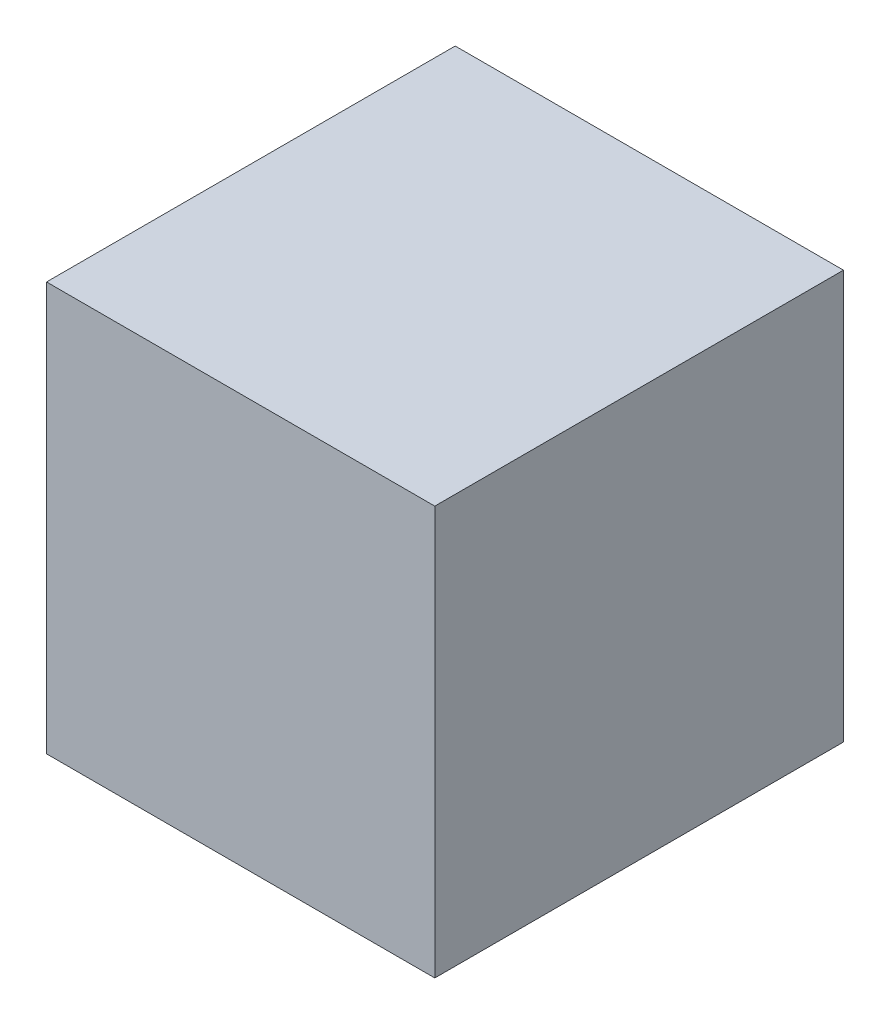
ISO-10303-21;
HEADER;
FILE_DESCRIPTION(('STEP AP214'),'2;1');
FILE_NAME('part.step','',(''),(''),'','','');
FILE_SCHEMA(('AUTOMOTIVE_DESIGN { 1 0 10303 214 1 1 1 1 }'));
ENDSEC;
DATA;
#1=APPLICATION_CONTEXT('core data for automotive mechanical design processes');
#2=APPLICATION_PROTOCOL_DEFINITION('international standard','automotive_design',2000,#1);
#3=PRODUCT_CONTEXT('',#1,'mechanical');
#4=PRODUCT('Part','Part','',(#3));
#5=PRODUCT_RELATED_PRODUCT_CATEGORY('part','',(#4));
#6=PRODUCT_DEFINITION_FORMATION('','',#4);
#7=PRODUCT_DEFINITION_CONTEXT('part definition',#1,'design');
#8=PRODUCT_DEFINITION('design','',#6,#7);
#9=PRODUCT_DEFINITION_SHAPE('','',#8);
#10=(LENGTH_UNIT() NAMED_UNIT(*) SI_UNIT(.MILLI.,.METRE.));
#11=(NAMED_UNIT(*) PLANE_ANGLE_UNIT() SI_UNIT($,.RADIAN.));
#12=(NAMED_UNIT(*) SI_UNIT($,.STERADIAN.) SOLID_ANGLE_UNIT());
#13=UNCERTAINTY_MEASURE_WITH_UNIT(LENGTH_MEASURE(1.E-05),#10,'distance_accuracy_value','');
#14=(GEOMETRIC_REPRESENTATION_CONTEXT(3) GLOBAL_UNCERTAINTY_ASSIGNED_CONTEXT((#13)) GLOBAL_UNIT_ASSIGNED_CONTEXT((#10,
#11,#12)) REPRESENTATION_CONTEXT('',''));
#15=CARTESIAN_POINT('',(0.,0.,0.));
#16=DIRECTION('',(0.,0.,1.));
#17=DIRECTION('',(1.,0.,0.));
#18=AXIS2_PLACEMENT_3D('',#15,#16,#17);
#19=CARTESIAN_POINT('',(0.,0.,0.2));
#20=DIRECTION('',(0.,0.,1.));
#21=DIRECTION('',(1.,0.,0.));
#22=AXIS2_PLACEMENT_3D('',#19,#20,#21);
#23=PLANE('',#22);
#24=DIRECTION('',(0.,1.,0.));
#25=VECTOR('',#24,1.);
#26=CARTESIAN_POINT('',(0.,0.,0.2));
#27=LINE('',#26,#25);
#28=CARTESIAN_POINT('',(0.,0.,0.2));
#29=VERTEX_POINT('',#28);
#30=CARTESIAN_POINT('',(0.,0.2,0.2));
#31=VERTEX_POINT('',#30);
#32=EDGE_CURVE('E77',#29,#31,#27,.T.);
#33=ORIENTED_EDGE('',*,*,#32,.F.);
#34=DIRECTION('',(1.,0.,0.));
#35=VECTOR('',#34,1.);
#36=CARTESIAN_POINT('',(0.,0.,0.2));
#37=LINE('',#36,#35);
#38=CARTESIAN_POINT('',(0.19,0.,0.2));
#39=VERTEX_POINT('',#38);
#40=EDGE_CURVE('E72',#29,#39,#37,.T.);
#41=ORIENTED_EDGE('',*,*,#40,.T.);
#42=DIRECTION('',(0.,1.,0.));
#43=VECTOR('',#42,1.);
#44=CARTESIAN_POINT('',(0.19,0.,0.2));
#45=LINE('',#44,#43);
#46=CARTESIAN_POINT('',(0.19,0.2,0.2));
#47=VERTEX_POINT('',#46);
#48=EDGE_CURVE('E74',#39,#47,#45,.T.);
#49=ORIENTED_EDGE('',*,*,#48,.T.);
#50=DIRECTION('',(1.,0.,0.));
#51=VECTOR('',#50,1.);
#52=CARTESIAN_POINT('',(0.,0.2,0.2));
#53=LINE('',#52,#51);
#54=EDGE_CURVE('E11',#31,#47,#53,.T.);
#55=ORIENTED_EDGE('',*,*,#54,.F.);
#56=EDGE_LOOP('',(#33,#41,#49,#55));
#57=FACE_BOUND('',#56,.T.);
#58=ADVANCED_FACE('F16',(#57),#23,.T.);
#59=CARTESIAN_POINT('',(0.,0.,0.));
#60=DIRECTION('',(0.,0.,1.));
#61=DIRECTION('',(1.,0.,0.));
#62=AXIS2_PLACEMENT_3D('',#59,#60,#61);
#63=PLANE('',#62);
#64=DIRECTION('',(0.,1.,0.));
#65=VECTOR('',#64,1.);
#66=CARTESIAN_POINT('',(0.,0.,0.));
#67=LINE('',#66,#65);
#68=CARTESIAN_POINT('',(0.,0.,0.));
#69=VERTEX_POINT('',#68);
#70=CARTESIAN_POINT('',(0.,0.2,0.));
#71=VERTEX_POINT('',#70);
#72=EDGE_CURVE('E92',#69,#71,#67,.T.);
#73=ORIENTED_EDGE('',*,*,#72,.T.);
#74=DIRECTION('',(1.,0.,0.));
#75=VECTOR('',#74,1.);
#76=CARTESIAN_POINT('',(0.,0.2,0.));
#77=LINE('',#76,#75);
#78=CARTESIAN_POINT('',(0.19,0.2,0.));
#79=VERTEX_POINT('',#78);
#80=EDGE_CURVE('E26',#71,#79,#77,.T.);
#81=ORIENTED_EDGE('',*,*,#80,.T.);
#82=DIRECTION('',(0.,1.,0.));
#83=VECTOR('',#82,1.);
#84=CARTESIAN_POINT('',(0.19,0.,0.));
#85=LINE('',#84,#83);
#86=CARTESIAN_POINT('',(0.19,0.,0.));
#87=VERTEX_POINT('',#86);
#88=EDGE_CURVE('E91',#87,#79,#85,.T.);
#89=ORIENTED_EDGE('',*,*,#88,.F.);
#90=DIRECTION('',(1.,0.,0.));
#91=VECTOR('',#90,1.);
#92=CARTESIAN_POINT('',(0.,0.,0.));
#93=LINE('',#92,#91);
#94=EDGE_CURVE('E65',#69,#87,#93,.T.);
#95=ORIENTED_EDGE('',*,*,#94,.F.);
#96=EDGE_LOOP('',(#73,#81,#89,#95));
#97=FACE_BOUND('',#96,.T.);
#98=ADVANCED_FACE('F115',(#97),#63,.F.);
#99=CARTESIAN_POINT('',(0.,0.2,0.));
#100=DIRECTION('',(0.,1.,0.));
#101=DIRECTION('',(1.,0.,0.));
#102=AXIS2_PLACEMENT_3D('',#99,#100,#101);
#103=PLANE('',#102);
#104=ORIENTED_EDGE('',*,*,#80,.F.);
#105=DIRECTION('',(0.,0.,1.));
#106=VECTOR('',#105,1.);
#107=CARTESIAN_POINT('',(0.,0.2,0.));
#108=LINE('',#107,#106);
#109=EDGE_CURVE('E19',#71,#31,#108,.T.);
#110=ORIENTED_EDGE('',*,*,#109,.T.);
#111=ORIENTED_EDGE('',*,*,#54,.T.);
#112=DIRECTION('',(0.,0.,1.));
#113=VECTOR('',#112,1.);
#114=CARTESIAN_POINT('',(0.19,0.2,0.));
#115=LINE('',#114,#113);
#116=EDGE_CURVE('E86',#79,#47,#115,.T.);
#117=ORIENTED_EDGE('',*,*,#116,.F.);
#118=EDGE_LOOP('',(#104,#110,#111,#117));
#119=FACE_BOUND('',#118,.T.);
#120=ADVANCED_FACE('F118',(#119),#103,.T.);
#121=CARTESIAN_POINT('',(0.,0.,0.));
#122=DIRECTION('',(0.,1.,0.));
#123=DIRECTION('',(1.,0.,0.));
#124=AXIS2_PLACEMENT_3D('',#121,#122,#123);
#125=PLANE('',#124);
#126=ORIENTED_EDGE('',*,*,#94,.T.);
#127=DIRECTION('',(0.,0.,1.));
#128=VECTOR('',#127,1.);
#129=CARTESIAN_POINT('',(0.19,0.,0.));
#130=LINE('',#129,#128);
#131=EDGE_CURVE('E85',#87,#39,#130,.T.);
#132=ORIENTED_EDGE('',*,*,#131,.T.);
#133=ORIENTED_EDGE('',*,*,#40,.F.);
#134=DIRECTION('',(0.,0.,1.));
#135=VECTOR('',#134,1.);
#136=CARTESIAN_POINT('',(0.,0.,0.));
#137=LINE('',#136,#135);
#138=EDGE_CURVE('E104',#69,#29,#137,.T.);
#139=ORIENTED_EDGE('',*,*,#138,.F.);
#140=EDGE_LOOP('',(#126,#132,#133,#139));
#141=FACE_BOUND('',#140,.T.);
#142=ADVANCED_FACE('F89',(#141),#125,.F.);
#143=CARTESIAN_POINT('',(0.19,0.,0.));
#144=DIRECTION('',(1.,0.,0.));
#145=DIRECTION('',(0.,1.,0.));
#146=AXIS2_PLACEMENT_3D('',#143,#144,#145);
#147=PLANE('',#146);
#148=ORIENTED_EDGE('',*,*,#131,.F.);
#149=ORIENTED_EDGE('',*,*,#88,.T.);
#150=ORIENTED_EDGE('',*,*,#116,.T.);
#151=ORIENTED_EDGE('',*,*,#48,.F.);
#152=EDGE_LOOP('',(#148,#149,#150,#151));
#153=FACE_BOUND('',#152,.T.);
#154=ADVANCED_FACE('F83',(#153),#147,.T.);
#155=CARTESIAN_POINT('',(0.,0.,0.));
#156=DIRECTION('',(1.,0.,0.));
#157=DIRECTION('',(0.,1.,0.));
#158=AXIS2_PLACEMENT_3D('',#155,#156,#157);
#159=PLANE('',#158);
#160=ORIENTED_EDGE('',*,*,#138,.T.);
#161=ORIENTED_EDGE('',*,*,#32,.T.);
#162=ORIENTED_EDGE('',*,*,#109,.F.);
#163=ORIENTED_EDGE('',*,*,#72,.F.);
#164=EDGE_LOOP('',(#160,#161,#162,#163));
#165=FACE_BOUND('',#164,.T.);
#166=ADVANCED_FACE('F164',(#165),#159,.F.);
#167=CLOSED_SHELL('',(#58,#98,#120,#142,#154,#166));
#168=MANIFOLD_SOLID_BREP('B1',#167);
#169=ADVANCED_BREP_SHAPE_REPRESENTATION('',(#18,#168),#14);
#170=SHAPE_DEFINITION_REPRESENTATION(#9,#169);
ENDSEC;
END-ISO-10303-21;
